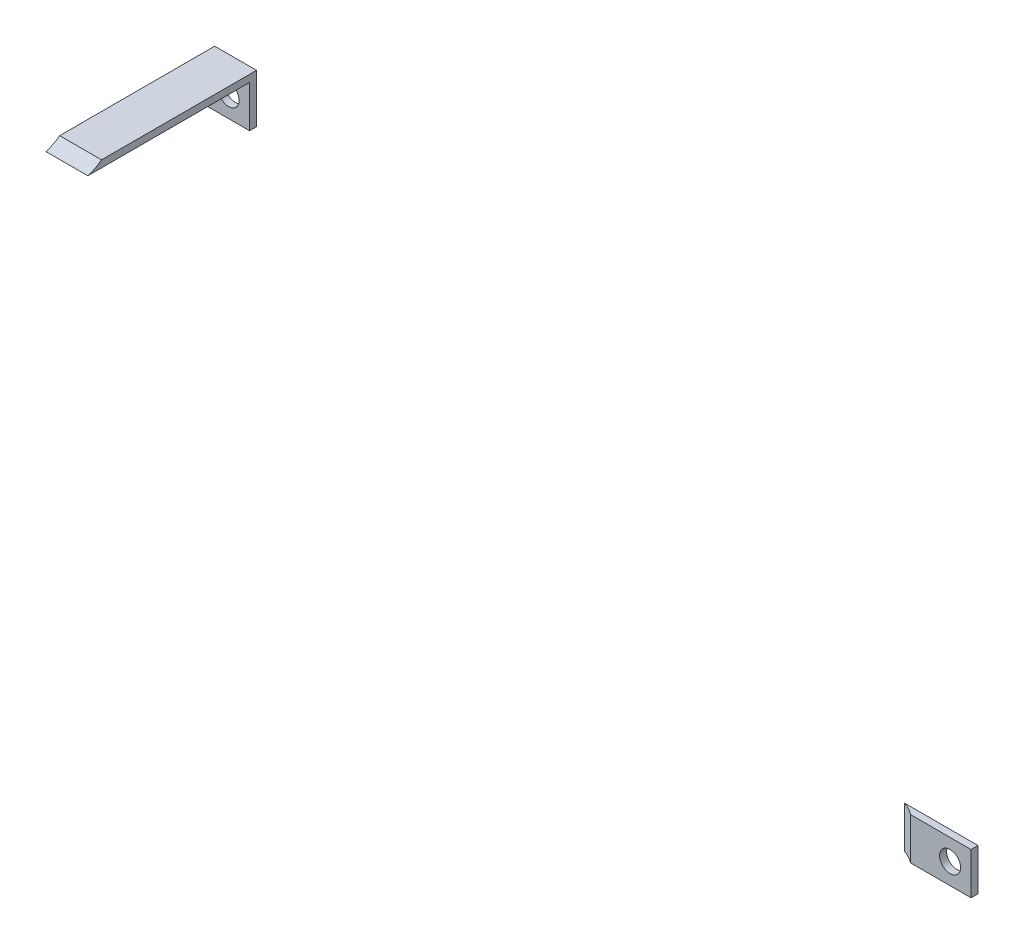
ISO-10303-21;
HEADER;
FILE_DESCRIPTION(('STEP AP214'),'2;1');
FILE_NAME('part.step','',(''),(''),'','','');
FILE_SCHEMA(('AUTOMOTIVE_DESIGN { 1 0 10303 214 1 1 1 1 }'));
ENDSEC;
DATA;
#1=APPLICATION_CONTEXT('core data for automotive mechanical design processes');
#2=APPLICATION_PROTOCOL_DEFINITION('international standard','automotive_design',2000,#1);
#3=PRODUCT_CONTEXT('',#1,'mechanical');
#4=PRODUCT('Part','Part','',(#3));
#5=PRODUCT_RELATED_PRODUCT_CATEGORY('part','',(#4));
#6=PRODUCT_DEFINITION_FORMATION('','',#4);
#7=PRODUCT_DEFINITION_CONTEXT('part definition',#1,'design');
#8=PRODUCT_DEFINITION('design','',#6,#7);
#9=PRODUCT_DEFINITION_SHAPE('','',#8);
#10=(LENGTH_UNIT() NAMED_UNIT(*) SI_UNIT(.MILLI.,.METRE.));
#11=(NAMED_UNIT(*) PLANE_ANGLE_UNIT() SI_UNIT($,.RADIAN.));
#12=(NAMED_UNIT(*) SI_UNIT($,.STERADIAN.) SOLID_ANGLE_UNIT());
#13=UNCERTAINTY_MEASURE_WITH_UNIT(LENGTH_MEASURE(1.E-05),#10,'distance_accuracy_value','');
#14=(GEOMETRIC_REPRESENTATION_CONTEXT(3) GLOBAL_UNCERTAINTY_ASSIGNED_CONTEXT((#13)) GLOBAL_UNIT_ASSIGNED_CONTEXT((#10,
#11,#12)) REPRESENTATION_CONTEXT('',''));
#15=CARTESIAN_POINT('',(0.,0.,0.));
#16=DIRECTION('',(0.,0.,1.));
#17=DIRECTION('',(1.,0.,0.));
#18=AXIS2_PLACEMENT_3D('',#15,#16,#17);
#19=CARTESIAN_POINT('',(-22.8519549129285,185.,-100.));
#20=DIRECTION('',(-1.,0.,0.));
#21=DIRECTION('',(0.,0.,-1.));
#22=AXIS2_PLACEMENT_3D('',#19,#20,#21);
#23=CYLINDRICAL_SURFACE('',#22,12.5);
#24=CARTESIAN_POINT('',(-34.8519549129285,185.,-112.5));
#25=CARTESIAN_POINT('',(-34.8519549129285,160.,-112.5));
#26=CARTESIAN_POINT('',(-34.8519549129285,160.,-87.5));
#27=CARTESIAN_POINT('',(-34.8519549129285,185.,-87.5));
#28=CARTESIAN_POINT('',(-34.8519549129285,210.,-87.5));
#29=CARTESIAN_POINT('',(-34.8519549129285,210.,-112.5));
#30=CARTESIAN_POINT('',(-34.8519549129285,185.,-112.5));
#31=(BOUNDED_CURVE() B_SPLINE_CURVE(3,(#24,#25,#26,#27,#28,#29,#30),.UNSPECIFIED.,.T.,
.F.) B_SPLINE_CURVE_WITH_KNOTS((4,3,4),(0.,0.5,1.),
.UNSPECIFIED.) CURVE() GEOMETRIC_REPRESENTATION_ITEM() RATIONAL_B_SPLINE_CURVE((1.,
0.333333333333333,0.333333333333333,1.,0.333333333333333,0.333333333333333,1.)) REPRESENTATION_ITEM(''));
#32=CARTESIAN_POINT('',(-34.8519549129285,175.040321072079,-107.553462494295));
#33=VERTEX_POINT('',#32);
#34=CARTESIAN_POINT('',(-34.8519549129285,173.040321072079,-103.635392680446));
#35=VERTEX_POINT('',#34);
#36=EDGE_CURVE('E131',#33,#35,#31,.T.);
#37=ORIENTED_EDGE('',*,*,#36,.T.);
#38=DIRECTION('',(-1.,0.,0.));
#39=VECTOR('',#38,1.);
#40=CARTESIAN_POINT('',(-22.8519549129285,173.040321072079,-103.635392680446));
#41=LINE('',#40,#39);
#42=CARTESIAN_POINT('',(-22.8519549129285,173.040321072079,-103.635392680446));
#43=VERTEX_POINT('',#42);
#44=EDGE_CURVE('E50',#43,#35,#41,.T.);
#45=ORIENTED_EDGE('',*,*,#44,.F.);
#46=CARTESIAN_POINT('',(-22.8519549129285,185.,-112.5));
#47=CARTESIAN_POINT('',(-22.8519549129285,160.,-112.5));
#48=CARTESIAN_POINT('',(-22.8519549129285,160.,-87.5));
#49=CARTESIAN_POINT('',(-22.8519549129285,185.,-87.5));
#50=CARTESIAN_POINT('',(-22.8519549129285,210.,-87.5));
#51=CARTESIAN_POINT('',(-22.8519549129285,210.,-112.5));
#52=CARTESIAN_POINT('',(-22.8519549129285,185.,-112.5));
#53=(BOUNDED_CURVE() B_SPLINE_CURVE(3,(#46,#47,#48,#49,#50,#51,#52),.UNSPECIFIED.,.T.,
.F.) B_SPLINE_CURVE_WITH_KNOTS((4,3,4),(0.,0.5,1.),
.UNSPECIFIED.) CURVE() GEOMETRIC_REPRESENTATION_ITEM() RATIONAL_B_SPLINE_CURVE((1.,
0.333333333333333,0.333333333333333,1.,0.333333333333333,0.333333333333333,1.)) REPRESENTATION_ITEM(''));
#54=CARTESIAN_POINT('',(-22.8519549129285,175.040321072079,-107.553462494295));
#55=VERTEX_POINT('',#54);
#56=EDGE_CURVE('E146',#55,#43,#53,.T.);
#57=ORIENTED_EDGE('',*,*,#56,.F.);
#58=DIRECTION('',(-1.,0.,0.));
#59=VECTOR('',#58,1.);
#60=CARTESIAN_POINT('',(-22.8519549129285,175.040321072079,-107.553462494295));
#61=LINE('',#60,#59);
#62=EDGE_CURVE('E12',#55,#33,#61,.T.);
#63=ORIENTED_EDGE('',*,*,#62,.T.);
#64=EDGE_LOOP('',(#37,#45,#57,#63));
#65=FACE_BOUND('',#64,.T.);
#66=ADVANCED_FACE('F47',(#65),#23,.F.);
#67=CARTESIAN_POINT('',(-22.8519549129285,175.040321072079,-107.553462494295));
#68=DIRECTION('',(0.,1.,0.));
#69=DIRECTION('',(0.,0.,-1.));
#70=AXIS2_PLACEMENT_3D('',#67,#68,#69);
#71=PLANE('',#70);
#72=DIRECTION('',(0.,0.,1.));
#73=VECTOR('',#72,1.);
#74=CARTESIAN_POINT('',(-34.8519549129285,175.040321072079,-107.553462494295));
#75=LINE('',#74,#73);
#76=CARTESIAN_POINT('',(-34.8519549129284,175.040321072076,-152.));
#77=VERTEX_POINT('',#76);
#78=EDGE_CURVE('E94',#77,#33,#75,.T.);
#79=ORIENTED_EDGE('',*,*,#78,.T.);
#80=ORIENTED_EDGE('',*,*,#62,.F.);
#81=DIRECTION('',(0.,0.,1.));
#82=VECTOR('',#81,1.);
#83=CARTESIAN_POINT('',(-22.8519549129285,175.040321072079,-107.553462494295));
#84=LINE('',#83,#82);
#85=CARTESIAN_POINT('',(-22.8519549129284,175.040321072076,-152.));
#86=VERTEX_POINT('',#85);
#87=EDGE_CURVE('E65',#86,#55,#84,.T.);
#88=ORIENTED_EDGE('',*,*,#87,.F.);
#89=DIRECTION('',(-1.,0.,0.));
#90=VECTOR('',#89,1.);
#91=CARTESIAN_POINT('',(-22.8519549129284,175.040321072076,-152.));
#92=LINE('',#91,#90);
#93=EDGE_CURVE('E56',#86,#77,#92,.T.);
#94=ORIENTED_EDGE('',*,*,#93,.T.);
#95=EDGE_LOOP('',(#79,#80,#88,#94));
#96=FACE_BOUND('',#95,.T.);
#97=ADVANCED_FACE('F187',(#96),#71,.T.);
#98=CARTESIAN_POINT('',(-22.8519549129284,175.040321072076,-152.));
#99=DIRECTION('',(0.,0.,-1.));
#100=DIRECTION('',(1.,0.,0.));
#101=AXIS2_PLACEMENT_3D('',#98,#99,#100);
#102=PLANE('',#101);
#103=CARTESIAN_POINT('',(-28.8519549129285,167.040321072076,-152.));
#104=DIRECTION('',(0.,0.,1.));
#105=DIRECTION('',(1.,0.,0.));
#106=AXIS2_PLACEMENT_3D('',#103,#104,#105);
#107=CIRCLE('',#106,2.99999999999999);
#108=CARTESIAN_POINT('',(-25.8519549129285,167.040321072076,-152.));
#109=VERTEX_POINT('',#108);
#110=EDGE_CURVE('E137',#109,#109,#107,.T.);
#111=ORIENTED_EDGE('',*,*,#110,.T.);
#112=EDGE_LOOP('',(#111));
#113=FACE_BOUND('',#112,.T.);
#114=DIRECTION('',(0.,1.,0.));
#115=VECTOR('',#114,1.);
#116=CARTESIAN_POINT('',(-34.8519549129284,175.040321072076,-152.));
#117=LINE('',#116,#115);
#118=CARTESIAN_POINT('',(-34.8519549129284,161.040321072076,-152.));
#119=VERTEX_POINT('',#118);
#120=EDGE_CURVE('E88',#119,#77,#117,.T.);
#121=ORIENTED_EDGE('',*,*,#120,.T.);
#122=ORIENTED_EDGE('',*,*,#93,.F.);
#123=DIRECTION('',(0.,1.,0.));
#124=VECTOR('',#123,1.);
#125=CARTESIAN_POINT('',(-22.8519549129284,175.040321072076,-152.));
#126=LINE('',#125,#124);
#127=CARTESIAN_POINT('',(-22.8519549129284,161.040321072076,-152.));
#128=VERTEX_POINT('',#127);
#129=EDGE_CURVE('E113',#128,#86,#126,.T.);
#130=ORIENTED_EDGE('',*,*,#129,.F.);
#131=DIRECTION('',(-1.,0.,0.));
#132=VECTOR('',#131,1.);
#133=CARTESIAN_POINT('',(-22.8519549129284,161.040321072076,-152.));
#134=LINE('',#133,#132);
#135=EDGE_CURVE('E120',#128,#119,#134,.T.);
#136=ORIENTED_EDGE('',*,*,#135,.T.);
#137=EDGE_LOOP('',(#121,#122,#130,#136));
#138=FACE_BOUND('',#137,.T.);
#139=ADVANCED_FACE('F126',(#113,#138),#102,.T.);
#140=CARTESIAN_POINT('',(-22.8519549129284,161.040321072076,-152.));
#141=DIRECTION('',(0.,-1.,0.));
#142=DIRECTION('',(0.,0.,1.));
#143=AXIS2_PLACEMENT_3D('',#140,#141,#142);
#144=PLANE('',#143);
#145=DIRECTION('',(0.,0.,-1.));
#146=VECTOR('',#145,1.);
#147=CARTESIAN_POINT('',(-34.8519549129284,161.040321072076,-152.));
#148=LINE('',#147,#146);
#149=CARTESIAN_POINT('',(-34.8519549129284,161.040321072076,-150.));
#150=VERTEX_POINT('',#149);
#151=EDGE_CURVE('E123',#150,#119,#148,.T.);
#152=ORIENTED_EDGE('',*,*,#151,.T.);
#153=ORIENTED_EDGE('',*,*,#135,.F.);
#154=DIRECTION('',(0.,0.,-1.));
#155=VECTOR('',#154,1.);
#156=CARTESIAN_POINT('',(-22.8519549129284,161.040321072076,-152.));
#157=LINE('',#156,#155);
#158=CARTESIAN_POINT('',(-22.8519549129284,161.040321072076,-150.));
#159=VERTEX_POINT('',#158);
#160=EDGE_CURVE('E109',#159,#128,#157,.T.);
#161=ORIENTED_EDGE('',*,*,#160,.F.);
#162=DIRECTION('',(-1.,0.,0.));
#163=VECTOR('',#162,1.);
#164=CARTESIAN_POINT('',(-22.8519549129284,161.040321072076,-150.));
#165=LINE('',#164,#163);
#166=EDGE_CURVE('E124',#159,#150,#165,.T.);
#167=ORIENTED_EDGE('',*,*,#166,.T.);
#168=EDGE_LOOP('',(#152,#153,#161,#167));
#169=FACE_BOUND('',#168,.T.);
#170=ADVANCED_FACE('F121',(#169),#144,.T.);
#171=CARTESIAN_POINT('',(-22.8519549129284,161.040321072076,-150.));
#172=DIRECTION('',(0.,0.,1.));
#173=DIRECTION('',(0.,1.,0.));
#174=AXIS2_PLACEMENT_3D('',#171,#172,#173);
#175=PLANE('',#174);
#176=CARTESIAN_POINT('',(-28.8519549129285,167.040321072076,-149.999999999999));
#177=DIRECTION('',(0.,0.,-1.));
#178=DIRECTION('',(0.,1.,0.));
#179=AXIS2_PLACEMENT_3D('',#176,#177,#178);
#180=CIRCLE('',#179,2.99999999999999);
#181=CARTESIAN_POINT('',(-28.8519549129285,170.040321072076,-149.999999999999));
#182=VERTEX_POINT('',#181);
#183=EDGE_CURVE('E171',#182,#182,#180,.T.);
#184=ORIENTED_EDGE('',*,*,#183,.T.);
#185=EDGE_LOOP('',(#184));
#186=FACE_BOUND('',#185,.T.);
#187=DIRECTION('',(0.,-1.,0.));
#188=VECTOR('',#187,1.);
#189=CARTESIAN_POINT('',(-34.8519549129284,161.040321072076,-150.));
#190=LINE('',#189,#188);
#191=CARTESIAN_POINT('',(-34.8519549129284,173.040321072076,-150.));
#192=VERTEX_POINT('',#191);
#193=EDGE_CURVE('E142',#192,#150,#190,.T.);
#194=ORIENTED_EDGE('',*,*,#193,.T.);
#195=ORIENTED_EDGE('',*,*,#166,.F.);
#196=DIRECTION('',(0.,-1.,0.));
#197=VECTOR('',#196,1.);
#198=CARTESIAN_POINT('',(-22.8519549129284,161.040321072076,-150.));
#199=LINE('',#198,#197);
#200=CARTESIAN_POINT('',(-22.8519549129284,173.040321072076,-150.));
#201=VERTEX_POINT('',#200);
#202=EDGE_CURVE('E115',#201,#159,#199,.T.);
#203=ORIENTED_EDGE('',*,*,#202,.F.);
#204=DIRECTION('',(-1.,0.,0.));
#205=VECTOR('',#204,1.);
#206=CARTESIAN_POINT('',(-22.8519549129284,173.040321072076,-150.));
#207=LINE('',#206,#205);
#208=EDGE_CURVE('E149',#201,#192,#207,.T.);
#209=ORIENTED_EDGE('',*,*,#208,.T.);
#210=EDGE_LOOP('',(#194,#195,#203,#209));
#211=FACE_BOUND('',#210,.T.);
#212=ADVANCED_FACE('F160',(#186,#211),#175,.T.);
#213=CARTESIAN_POINT('',(-22.8519549129284,173.040321072076,-150.));
#214=DIRECTION('',(0.,-1.,0.));
#215=DIRECTION('',(0.,0.,1.));
#216=AXIS2_PLACEMENT_3D('',#213,#214,#215);
#217=PLANE('',#216);
#218=DIRECTION('',(0.,0.,-1.));
#219=VECTOR('',#218,1.);
#220=CARTESIAN_POINT('',(-34.8519549129284,173.040321072076,-150.));
#221=LINE('',#220,#219);
#222=EDGE_CURVE('E136',#35,#192,#221,.T.);
#223=ORIENTED_EDGE('',*,*,#222,.T.);
#224=ORIENTED_EDGE('',*,*,#208,.F.);
#225=DIRECTION('',(0.,0.,-1.));
#226=VECTOR('',#225,1.);
#227=CARTESIAN_POINT('',(-22.8519549129284,173.040321072076,-150.));
#228=LINE('',#227,#226);
#229=EDGE_CURVE('E102',#43,#201,#228,.T.);
#230=ORIENTED_EDGE('',*,*,#229,.F.);
#231=ORIENTED_EDGE('',*,*,#44,.T.);
#232=EDGE_LOOP('',(#223,#224,#230,#231));
#233=FACE_BOUND('',#232,.T.);
#234=ADVANCED_FACE('F154',(#233),#217,.T.);
#235=CARTESIAN_POINT('',(-22.8519549129285,185.,-87.5));
#236=DIRECTION('',(-1.,0.,0.));
#237=DIRECTION('',(0.,0.,-1.));
#238=AXIS2_PLACEMENT_3D('',#235,#236,#237);
#239=PLANE('',#238);
#240=ORIENTED_EDGE('',*,*,#56,.T.);
#241=ORIENTED_EDGE('',*,*,#229,.T.);
#242=ORIENTED_EDGE('',*,*,#202,.T.);
#243=ORIENTED_EDGE('',*,*,#160,.T.);
#244=ORIENTED_EDGE('',*,*,#129,.T.);
#245=ORIENTED_EDGE('',*,*,#87,.T.);
#246=EDGE_LOOP('',(#240,#241,#242,#243,#244,#245));
#247=FACE_BOUND('',#246,.T.);
#248=ADVANCED_FACE('F111',(#247),#239,.F.);
#249=CARTESIAN_POINT('',(-34.8519549129285,185.,-87.5));
#250=DIRECTION('',(-1.,0.,0.));
#251=DIRECTION('',(0.,0.,-1.));
#252=AXIS2_PLACEMENT_3D('',#249,#250,#251);
#253=PLANE('',#252);
#254=ORIENTED_EDGE('',*,*,#36,.F.);
#255=ORIENTED_EDGE('',*,*,#78,.F.);
#256=ORIENTED_EDGE('',*,*,#120,.F.);
#257=ORIENTED_EDGE('',*,*,#151,.F.);
#258=ORIENTED_EDGE('',*,*,#193,.F.);
#259=ORIENTED_EDGE('',*,*,#222,.F.);
#260=EDGE_LOOP('',(#254,#255,#256,#257,#258,#259));
#261=FACE_BOUND('',#260,.T.);
#262=ADVANCED_FACE('F159',(#261),#253,.T.);
#263=CARTESIAN_POINT('',(-28.8519549129284,167.040321072076,-161.999999999999));
#264=DIRECTION('',(0.,0.,1.));
#265=DIRECTION('',(0.,1.,0.));
#266=AXIS2_PLACEMENT_3D('',#263,#264,#265);
#267=CYLINDRICAL_SURFACE('',#266,2.99999999999999);
#268=ORIENTED_EDGE('',*,*,#110,.F.);
#269=EDGE_LOOP('',(#268));
#270=FACE_BOUND('',#269,.T.);
#271=ORIENTED_EDGE('',*,*,#183,.F.);
#272=EDGE_LOOP('',(#271));
#273=FACE_BOUND('',#272,.T.);
#274=ADVANCED_FACE('F176',(#270,#273),#267,.F.);
#275=CLOSED_SHELL('',(#66,#97,#139,#170,#212,#234,#248,#262,#274));
#276=MANIFOLD_SOLID_BREP('B2',#275);
#277=CARTESIAN_POINT('',(200.00983325722,127.,-99.1338889880595));
#278=DIRECTION('',(0.,-1.,0.));
#279=DIRECTION('',(0.,0.,1.));
#280=AXIS2_PLACEMENT_3D('',#277,#278,#279);
#281=CYLINDRICAL_SURFACE('',#280,12.5);
#282=CARTESIAN_POINT('',(200.00983325722,115.,-99.1338889880595));
#283=DIRECTION('',(0.,-1.,0.));
#284=DIRECTION('',(0.,0.,1.));
#285=AXIS2_PLACEMENT_3D('',#282,#283,#284);
#286=CIRCLE('',#285,12.5);
#287=CARTESIAN_POINT('',(203.939898072501,115.,-111.));
#288=VERTEX_POINT('',#287);
#289=CARTESIAN_POINT('',(207.685108724594,115.,-109.));
#290=VERTEX_POINT('',#289);
#291=EDGE_CURVE('E318',#288,#290,#286,.T.);
#292=ORIENTED_EDGE('',*,*,#291,.T.);
#293=DIRECTION('',(0.,-1.,0.));
#294=VECTOR('',#293,1.);
#295=CARTESIAN_POINT('',(207.685108724594,127.,-109.));
#296=LINE('',#295,#294);
#297=CARTESIAN_POINT('',(207.685108724594,127.,-109.));
#298=VERTEX_POINT('',#297);
#299=EDGE_CURVE('E257',#298,#290,#296,.T.);
#300=ORIENTED_EDGE('',*,*,#299,.F.);
#301=CARTESIAN_POINT('',(200.00983325722,127.,-99.1338889880595));
#302=DIRECTION('',(0.,-1.,0.));
#303=DIRECTION('',(0.,0.,1.));
#304=AXIS2_PLACEMENT_3D('',#301,#302,#303);
#305=CIRCLE('',#304,12.5);
#306=CARTESIAN_POINT('',(203.939898072501,127.,-111.));
#307=VERTEX_POINT('',#306);
#308=EDGE_CURVE('E307',#307,#298,#305,.T.);
#309=ORIENTED_EDGE('',*,*,#308,.F.);
#310=DIRECTION('',(0.,-1.,0.));
#311=VECTOR('',#310,1.);
#312=CARTESIAN_POINT('',(203.939898072501,127.,-111.));
#313=LINE('',#312,#311);
#314=EDGE_CURVE('E45',#307,#288,#313,.T.);
#315=ORIENTED_EDGE('',*,*,#314,.T.);
#316=EDGE_LOOP('',(#292,#300,#309,#315));
#317=FACE_BOUND('',#316,.T.);
#318=ADVANCED_FACE('F254',(#317),#281,.F.);
#319=CARTESIAN_POINT('',(203.939898072501,127.,-111.));
#320=DIRECTION('',(0.,0.,-1.));
#321=DIRECTION('',(1.,0.,0.));
#322=AXIS2_PLACEMENT_3D('',#319,#320,#321);
#323=PLANE('',#322);
#324=CARTESIAN_POINT('',(219.,121.,-111.));
#325=DIRECTION('',(0.,0.,1.));
#326=DIRECTION('',(1.,0.,0.));
#327=AXIS2_PLACEMENT_3D('',#324,#325,#326);
#328=CIRCLE('',#327,2.99999999999999);
#329=CARTESIAN_POINT('',(222.,121.,-111.));
#330=VERTEX_POINT('',#329);
#331=EDGE_CURVE('E321',#330,#330,#328,.T.);
#332=ORIENTED_EDGE('',*,*,#331,.T.);
#333=EDGE_LOOP('',(#332));
#334=FACE_BOUND('',#333,.T.);
#335=DIRECTION('',(-1.,0.,0.));
#336=VECTOR('',#335,1.);
#337=CARTESIAN_POINT('',(203.939898072501,115.,-111.));
#338=LINE('',#337,#336);
#339=CARTESIAN_POINT('',(225.,115.,-111.));
#340=VERTEX_POINT('',#339);
#341=EDGE_CURVE('E295',#340,#288,#338,.T.);
#342=ORIENTED_EDGE('',*,*,#341,.T.);
#343=ORIENTED_EDGE('',*,*,#314,.F.);
#344=DIRECTION('',(-1.,0.,0.));
#345=VECTOR('',#344,1.);
#346=CARTESIAN_POINT('',(203.939898072501,127.,-111.));
#347=LINE('',#346,#345);
#348=CARTESIAN_POINT('',(225.,127.,-111.));
#349=VERTEX_POINT('',#348);
#350=EDGE_CURVE('E272',#349,#307,#347,.T.);
#351=ORIENTED_EDGE('',*,*,#350,.F.);
#352=DIRECTION('',(0.,-1.,0.));
#353=VECTOR('',#352,1.);
#354=CARTESIAN_POINT('',(225.,127.,-111.));
#355=LINE('',#354,#353);
#356=EDGE_CURVE('E263',#349,#340,#355,.T.);
#357=ORIENTED_EDGE('',*,*,#356,.T.);
#358=EDGE_LOOP('',(#342,#343,#351,#357));
#359=FACE_BOUND('',#358,.T.);
#360=ADVANCED_FACE('F325',(#334,#359),#323,.T.);
#361=CARTESIAN_POINT('',(225.,127.,-111.));
#362=DIRECTION('',(1.,0.,0.));
#363=DIRECTION('',(0.,0.,1.));
#364=AXIS2_PLACEMENT_3D('',#361,#362,#363);
#365=PLANE('',#364);
#366=DIRECTION('',(0.,0.,-1.));
#367=VECTOR('',#366,1.);
#368=CARTESIAN_POINT('',(225.,115.,-111.));
#369=LINE('',#368,#367);
#370=CARTESIAN_POINT('',(225.,115.,-109.));
#371=VERTEX_POINT('',#370);
#372=EDGE_CURVE('E289',#371,#340,#369,.T.);
#373=ORIENTED_EDGE('',*,*,#372,.T.);
#374=ORIENTED_EDGE('',*,*,#356,.F.);
#375=DIRECTION('',(0.,0.,-1.));
#376=VECTOR('',#375,1.);
#377=CARTESIAN_POINT('',(225.,127.,-111.));
#378=LINE('',#377,#376);
#379=CARTESIAN_POINT('',(225.,127.,-109.));
#380=VERTEX_POINT('',#379);
#381=EDGE_CURVE('E305',#380,#349,#378,.T.);
#382=ORIENTED_EDGE('',*,*,#381,.F.);
#383=DIRECTION('',(0.,-1.,0.));
#384=VECTOR('',#383,1.);
#385=CARTESIAN_POINT('',(225.,127.,-109.));
#386=LINE('',#385,#384);
#387=EDGE_CURVE('E310',#380,#371,#386,.T.);
#388=ORIENTED_EDGE('',*,*,#387,.T.);
#389=EDGE_LOOP('',(#373,#374,#382,#388));
#390=FACE_BOUND('',#389,.T.);
#391=ADVANCED_FACE('F313',(#390),#365,.T.);
#392=CARTESIAN_POINT('',(225.,127.,-109.));
#393=DIRECTION('',(0.,0.,1.));
#394=DIRECTION('',(-1.,0.,0.));
#395=AXIS2_PLACEMENT_3D('',#392,#393,#394);
#396=PLANE('',#395);
#397=CARTESIAN_POINT('',(219.,121.,-109.));
#398=DIRECTION('',(0.,0.,-1.));
#399=DIRECTION('',(-1.,0.,0.));
#400=AXIS2_PLACEMENT_3D('',#397,#398,#399);
#401=CIRCLE('',#400,2.99999999999999);
#402=CARTESIAN_POINT('',(216.,121.,-109.));
#403=VERTEX_POINT('',#402);
#404=EDGE_CURVE('E333',#403,#403,#401,.T.);
#405=ORIENTED_EDGE('',*,*,#404,.T.);
#406=EDGE_LOOP('',(#405));
#407=FACE_BOUND('',#406,.T.);
#408=DIRECTION('',(1.,0.,0.));
#409=VECTOR('',#408,1.);
#410=CARTESIAN_POINT('',(225.,115.,-109.));
#411=LINE('',#410,#409);
#412=EDGE_CURVE('E312',#290,#371,#411,.T.);
#413=ORIENTED_EDGE('',*,*,#412,.T.);
#414=ORIENTED_EDGE('',*,*,#387,.F.);
#415=DIRECTION('',(1.,0.,0.));
#416=VECTOR('',#415,1.);
#417=CARTESIAN_POINT('',(225.,127.,-109.));
#418=LINE('',#417,#416);
#419=EDGE_CURVE('E302',#298,#380,#418,.T.);
#420=ORIENTED_EDGE('',*,*,#419,.F.);
#421=ORIENTED_EDGE('',*,*,#299,.T.);
#422=EDGE_LOOP('',(#413,#414,#420,#421));
#423=FACE_BOUND('',#422,.T.);
#424=ADVANCED_FACE('F311',(#407,#423),#396,.T.);
#425=CARTESIAN_POINT('',(200.00983325722,127.,-99.1338889880595));
#426=DIRECTION('',(0.,-1.,0.));
#427=DIRECTION('',(0.,0.,1.));
#428=AXIS2_PLACEMENT_3D('',#425,#426,#427);
#429=PLANE('',#428);
#430=ORIENTED_EDGE('',*,*,#308,.T.);
#431=ORIENTED_EDGE('',*,*,#419,.T.);
#432=ORIENTED_EDGE('',*,*,#381,.T.);
#433=ORIENTED_EDGE('',*,*,#350,.T.);
#434=EDGE_LOOP('',(#430,#431,#432,#433));
#435=FACE_BOUND('',#434,.T.);
#436=ADVANCED_FACE('F303',(#435),#429,.F.);
#437=CARTESIAN_POINT('',(200.00983325722,115.,-99.1338889880595));
#438=DIRECTION('',(0.,-1.,0.));
#439=DIRECTION('',(0.,0.,1.));
#440=AXIS2_PLACEMENT_3D('',#437,#438,#439);
#441=PLANE('',#440);
#442=ORIENTED_EDGE('',*,*,#291,.F.);
#443=ORIENTED_EDGE('',*,*,#341,.F.);
#444=ORIENTED_EDGE('',*,*,#372,.F.);
#445=ORIENTED_EDGE('',*,*,#412,.F.);
#446=EDGE_LOOP('',(#442,#443,#444,#445));
#447=FACE_BOUND('',#446,.T.);
#448=ADVANCED_FACE('F328',(#447),#441,.T.);
#449=CARTESIAN_POINT('',(219.,121.,-124.));
#450=DIRECTION('',(0.,0.,1.));
#451=DIRECTION('',(-1.,0.,0.));
#452=AXIS2_PLACEMENT_3D('',#449,#450,#451);
#453=CYLINDRICAL_SURFACE('',#452,2.99999999999999);
#454=ORIENTED_EDGE('',*,*,#331,.F.);
#455=EDGE_LOOP('',(#454));
#456=FACE_BOUND('',#455,.T.);
#457=ORIENTED_EDGE('',*,*,#404,.F.);
#458=EDGE_LOOP('',(#457));
#459=FACE_BOUND('',#458,.T.);
#460=ADVANCED_FACE('F338',(#456,#459),#453,.F.);
#461=CLOSED_SHELL('',(#318,#360,#391,#424,#436,#448,#460));
#462=MANIFOLD_SOLID_BREP('B6',#461);
#463=ADVANCED_BREP_SHAPE_REPRESENTATION('',(#18,#276,#462),#14);
#464=SHAPE_DEFINITION_REPRESENTATION(#9,#463);
ENDSEC;
END-ISO-10303-21;
